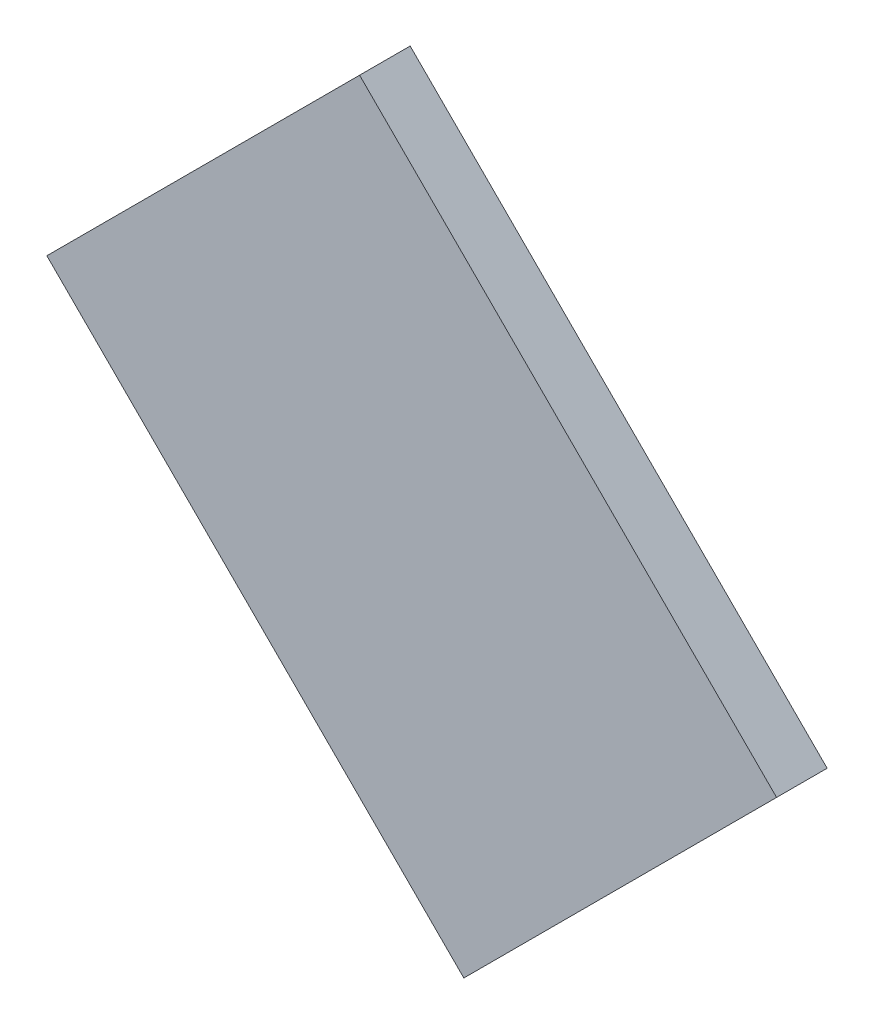
ISO-10303-21;
HEADER;
FILE_DESCRIPTION(('STEP AP214'),'2;1');
FILE_NAME('part.step','',(''),(''),'','','');
FILE_SCHEMA(('AUTOMOTIVE_DESIGN { 1 0 10303 214 1 1 1 1 }'));
ENDSEC;
DATA;
#1=APPLICATION_CONTEXT('core data for automotive mechanical design processes');
#2=APPLICATION_PROTOCOL_DEFINITION('international standard','automotive_design',2000,#1);
#3=PRODUCT_CONTEXT('',#1,'mechanical');
#4=PRODUCT('Part','Part','',(#3));
#5=PRODUCT_RELATED_PRODUCT_CATEGORY('part','',(#4));
#6=PRODUCT_DEFINITION_FORMATION('','',#4);
#7=PRODUCT_DEFINITION_CONTEXT('part definition',#1,'design');
#8=PRODUCT_DEFINITION('design','',#6,#7);
#9=PRODUCT_DEFINITION_SHAPE('','',#8);
#10=(LENGTH_UNIT() NAMED_UNIT(*) SI_UNIT(.MILLI.,.METRE.));
#11=(NAMED_UNIT(*) PLANE_ANGLE_UNIT() SI_UNIT($,.RADIAN.));
#12=(NAMED_UNIT(*) SI_UNIT($,.STERADIAN.) SOLID_ANGLE_UNIT());
#13=UNCERTAINTY_MEASURE_WITH_UNIT(LENGTH_MEASURE(1.E-05),#10,'distance_accuracy_value','');
#14=(GEOMETRIC_REPRESENTATION_CONTEXT(3) GLOBAL_UNCERTAINTY_ASSIGNED_CONTEXT((#13)) GLOBAL_UNIT_ASSIGNED_CONTEXT((#10,
#11,#12)) REPRESENTATION_CONTEXT('',''));
#15=CARTESIAN_POINT('',(0.,0.,0.));
#16=DIRECTION('',(0.,0.,1.));
#17=DIRECTION('',(1.,0.,0.));
#18=AXIS2_PLACEMENT_3D('',#15,#16,#17);
#19=CARTESIAN_POINT('',(7.5125453335,8.4495453335,0.76487));
#20=DIRECTION('',(0.,0.,-1.));
#21=DIRECTION('',(0.,1.,0.));
#22=AXIS2_PLACEMENT_3D('',#19,#20,#21);
#23=PLANE('',#22);
#24=DIRECTION('',(0.707106781186548,0.707106781186548,0.));
#25=VECTOR('',#24,1.);
#26=CARTESIAN_POINT('',(7.265058,8.484900667,0.76487));
#27=LINE('',#26,#25);
#28=CARTESIAN_POINT('',(7.265058,8.484900667,0.76487));
#29=VERTEX_POINT('',#28);
#30=CARTESIAN_POINT('',(7.47719,8.697032667,0.76487));
#31=VERTEX_POINT('',#30);
#32=EDGE_CURVE('E55',#29,#31,#27,.T.);
#33=ORIENTED_EDGE('',*,*,#32,.T.);
#34=DIRECTION('',(0.707106781186548,-0.707106781186548,0.));
#35=VECTOR('',#34,1.);
#36=CARTESIAN_POINT('',(7.47719,8.697032667,0.76487));
#37=LINE('',#36,#35);
#38=CARTESIAN_POINT('',(7.760032667,8.41419,0.76487));
#39=VERTEX_POINT('',#38);
#40=EDGE_CURVE('E57',#31,#39,#37,.T.);
#41=ORIENTED_EDGE('',*,*,#40,.T.);
#42=DIRECTION('',(-0.707106781186548,-0.707106781186548,0.));
#43=VECTOR('',#42,1.);
#44=CARTESIAN_POINT('',(7.760032667,8.41419,0.76487));
#45=LINE('',#44,#43);
#46=CARTESIAN_POINT('',(7.547900667,8.202058,0.76487));
#47=VERTEX_POINT('',#46);
#48=EDGE_CURVE('E20',#39,#47,#45,.T.);
#49=ORIENTED_EDGE('',*,*,#48,.T.);
#50=DIRECTION('',(-0.707106781186548,0.707106781186548,0.));
#51=VECTOR('',#50,1.);
#52=CARTESIAN_POINT('',(7.547900667,8.202058,0.76487));
#53=LINE('',#52,#51);
#54=EDGE_CURVE('E80',#47,#29,#53,.T.);
#55=ORIENTED_EDGE('',*,*,#54,.T.);
#56=EDGE_LOOP('',(#33,#41,#49,#55));
#57=FACE_BOUND('',#56,.T.);
#58=ADVANCED_FACE('F17',(#57),#23,.T.);
#59=CARTESIAN_POINT('',(7.760032667,8.41419,0.76487));
#60=DIRECTION('',(-0.707106781186548,0.707106781186548,0.));
#61=DIRECTION('',(-0.707106781186548,-0.707106781186548,0.));
#62=AXIS2_PLACEMENT_3D('',#59,#60,#61);
#63=PLANE('',#62);
#64=DIRECTION('',(0.,0.,1.));
#65=VECTOR('',#64,1.);
#66=CARTESIAN_POINT('',(7.547900667,8.202058,0.76487));
#67=LINE('',#66,#65);
#68=CARTESIAN_POINT('',(7.547900667,8.202058,0.79916));
#69=VERTEX_POINT('',#68);
#70=EDGE_CURVE('E68',#69,#47,#67,.F.);
#71=ORIENTED_EDGE('',*,*,#70,.T.);
#72=ORIENTED_EDGE('',*,*,#48,.F.);
#73=DIRECTION('',(0.,0.,1.));
#74=VECTOR('',#73,1.);
#75=CARTESIAN_POINT('',(7.760032667,8.41419,0.76487));
#76=LINE('',#75,#74);
#77=CARTESIAN_POINT('',(7.760032667,8.41419,0.79916));
#78=VERTEX_POINT('',#77);
#79=EDGE_CURVE('E63',#39,#78,#76,.T.);
#80=ORIENTED_EDGE('',*,*,#79,.T.);
#81=DIRECTION('',(0.707106781186546,0.707106781186549,0.));
#82=VECTOR('',#81,1.);
#83=CARTESIAN_POINT('',(7.547900667,8.202058,0.79916));
#84=LINE('',#83,#82);
#85=EDGE_CURVE('E83',#69,#78,#84,.T.);
#86=ORIENTED_EDGE('',*,*,#85,.F.);
#87=EDGE_LOOP('',(#71,#72,#80,#86));
#88=FACE_BOUND('',#87,.T.);
#89=ADVANCED_FACE('F65',(#88),#63,.F.);
#90=CARTESIAN_POINT('',(7.47719,8.697032667,0.76487));
#91=DIRECTION('',(-0.707106781186548,-0.707106781186548,0.));
#92=DIRECTION('',(0.707106781186548,-0.707106781186548,0.));
#93=AXIS2_PLACEMENT_3D('',#90,#91,#92);
#94=PLANE('',#93);
#95=ORIENTED_EDGE('',*,*,#79,.F.);
#96=ORIENTED_EDGE('',*,*,#40,.F.);
#97=DIRECTION('',(0.,0.,1.));
#98=VECTOR('',#97,1.);
#99=CARTESIAN_POINT('',(7.47719,8.697032667,0.76487));
#100=LINE('',#99,#98);
#101=CARTESIAN_POINT('',(7.47719,8.697032667,0.79916));
#102=VERTEX_POINT('',#101);
#103=EDGE_CURVE('E75',#31,#102,#100,.T.);
#104=ORIENTED_EDGE('',*,*,#103,.T.);
#105=DIRECTION('',(-0.707106781186546,0.707106781186549,0.));
#106=VECTOR('',#105,1.);
#107=CARTESIAN_POINT('',(7.760032667,8.41419,0.79916));
#108=LINE('',#107,#106);
#109=EDGE_CURVE('E72',#78,#102,#108,.T.);
#110=ORIENTED_EDGE('',*,*,#109,.F.);
#111=EDGE_LOOP('',(#95,#96,#104,#110));
#112=FACE_BOUND('',#111,.T.);
#113=ADVANCED_FACE('F70',(#112),#94,.F.);
#114=CARTESIAN_POINT('',(7.265058,8.484900667,0.76487));
#115=DIRECTION('',(0.707106781186548,-0.707106781186548,0.));
#116=DIRECTION('',(0.707106781186548,0.707106781186548,0.));
#117=AXIS2_PLACEMENT_3D('',#114,#115,#116);
#118=PLANE('',#117);
#119=ORIENTED_EDGE('',*,*,#103,.F.);
#120=ORIENTED_EDGE('',*,*,#32,.F.);
#121=DIRECTION('',(0.,0.,1.));
#122=VECTOR('',#121,1.);
#123=CARTESIAN_POINT('',(7.265058,8.484900667,0.76487));
#124=LINE('',#123,#122);
#125=CARTESIAN_POINT('',(7.265058,8.484900667,0.79916));
#126=VERTEX_POINT('',#125);
#127=EDGE_CURVE('E35',#29,#126,#124,.T.);
#128=ORIENTED_EDGE('',*,*,#127,.T.);
#129=DIRECTION('',(-0.707106781186549,-0.707106781186546,0.));
#130=VECTOR('',#129,1.);
#131=CARTESIAN_POINT('',(7.47719,8.697032667,0.79916));
#132=LINE('',#131,#130);
#133=EDGE_CURVE('E26',#102,#126,#132,.T.);
#134=ORIENTED_EDGE('',*,*,#133,.F.);
#135=EDGE_LOOP('',(#119,#120,#128,#134));
#136=FACE_BOUND('',#135,.T.);
#137=ADVANCED_FACE('F89',(#136),#118,.F.);
#138=CARTESIAN_POINT('',(7.547900667,8.202058,0.76487));
#139=DIRECTION('',(0.707106781186548,0.707106781186548,0.));
#140=DIRECTION('',(-0.707106781186548,0.707106781186548,0.));
#141=AXIS2_PLACEMENT_3D('',#138,#139,#140);
#142=PLANE('',#141);
#143=ORIENTED_EDGE('',*,*,#127,.F.);
#144=ORIENTED_EDGE('',*,*,#54,.F.);
#145=ORIENTED_EDGE('',*,*,#70,.F.);
#146=DIRECTION('',(0.707106781186549,-0.707106781186546,0.));
#147=VECTOR('',#146,1.);
#148=CARTESIAN_POINT('',(7.265058,8.484900667,0.79916));
#149=LINE('',#148,#147);
#150=EDGE_CURVE('E11',#126,#69,#149,.T.);
#151=ORIENTED_EDGE('',*,*,#150,.F.);
#152=EDGE_LOOP('',(#143,#144,#145,#151));
#153=FACE_BOUND('',#152,.T.);
#154=ADVANCED_FACE('F91',(#153),#142,.F.);
#155=CARTESIAN_POINT('',(7.5125453335,8.4495453335,0.79916));
#156=DIRECTION('',(0.,0.,1.));
#157=DIRECTION('',(0.,-1.,0.));
#158=AXIS2_PLACEMENT_3D('',#155,#156,#157);
#159=PLANE('',#158);
#160=ORIENTED_EDGE('',*,*,#133,.T.);
#161=ORIENTED_EDGE('',*,*,#150,.T.);
#162=ORIENTED_EDGE('',*,*,#85,.T.);
#163=ORIENTED_EDGE('',*,*,#109,.T.);
#164=EDGE_LOOP('',(#160,#161,#162,#163));
#165=FACE_BOUND('',#164,.T.);
#166=ADVANCED_FACE('F88',(#165),#159,.T.);
#167=CLOSED_SHELL('',(#58,#89,#113,#137,#154,#166));
#168=MANIFOLD_SOLID_BREP('B1',#167);
#169=ADVANCED_BREP_SHAPE_REPRESENTATION('',(#18,#168),#14);
#170=SHAPE_DEFINITION_REPRESENTATION(#9,#169);
ENDSEC;
END-ISO-10303-21;
